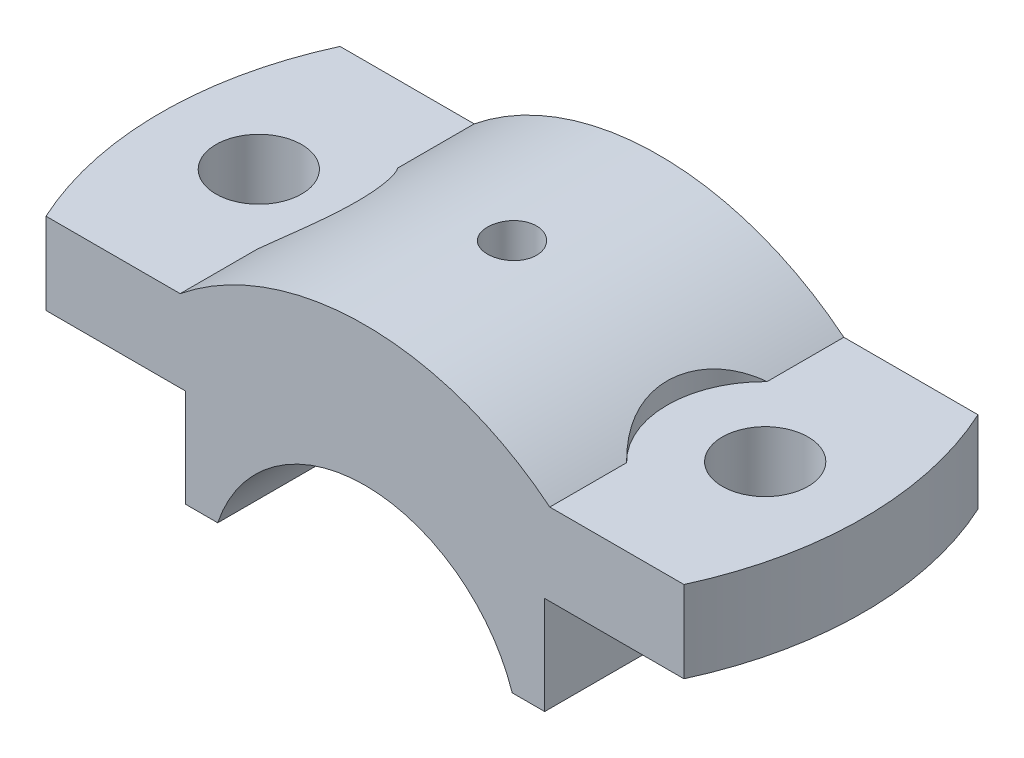
ISO-10303-21;
HEADER;
FILE_DESCRIPTION(('STEP AP214'),'2;1');
FILE_NAME('part.step','',(''),(''),'','','');
FILE_SCHEMA(('AUTOMOTIVE_DESIGN { 1 0 10303 214 1 1 1 1 }'));
ENDSEC;
DATA;
#1=APPLICATION_CONTEXT('core data for automotive mechanical design processes');
#2=APPLICATION_PROTOCOL_DEFINITION('international standard','automotive_design',2000,#1);
#3=PRODUCT_CONTEXT('',#1,'mechanical');
#4=PRODUCT('Part','Part','',(#3));
#5=PRODUCT_RELATED_PRODUCT_CATEGORY('part','',(#4));
#6=PRODUCT_DEFINITION_FORMATION('','',#4);
#7=PRODUCT_DEFINITION_CONTEXT('part definition',#1,'design');
#8=PRODUCT_DEFINITION('design','',#6,#7);
#9=PRODUCT_DEFINITION_SHAPE('','',#8);
#10=(LENGTH_UNIT() NAMED_UNIT(*) SI_UNIT(.MILLI.,.METRE.));
#11=(NAMED_UNIT(*) PLANE_ANGLE_UNIT() SI_UNIT($,.RADIAN.));
#12=(NAMED_UNIT(*) SI_UNIT($,.STERADIAN.) SOLID_ANGLE_UNIT());
#13=UNCERTAINTY_MEASURE_WITH_UNIT(LENGTH_MEASURE(1.E-05),#10,'distance_accuracy_value','');
#14=(GEOMETRIC_REPRESENTATION_CONTEXT(3) GLOBAL_UNCERTAINTY_ASSIGNED_CONTEXT((#13)) GLOBAL_UNIT_ASSIGNED_CONTEXT((#10,
#11,#12)) REPRESENTATION_CONTEXT('',''));
#15=CARTESIAN_POINT('',(0.,0.,0.));
#16=DIRECTION('',(0.,0.,1.));
#17=DIRECTION('',(1.,0.,0.));
#18=AXIS2_PLACEMENT_3D('',#15,#16,#17);
#19=CARTESIAN_POINT('',(0.,-7.77371006458449,36.));
#20=DIRECTION('',(0.,0.,-1.));
#21=DIRECTION('',(-1.,0.,0.));
#22=AXIS2_PLACEMENT_3D('',#19,#20,#21);
#23=CYLINDRICAL_SURFACE('',#22,36.);
#24=CARTESIAN_POINT('',(-3.,28.1010721647197,18.));
#25=CARTESIAN_POINT('',(-2.99999265249114,28.1010738236663,18.1681971263712));
#26=CARTESIAN_POINT('',(-2.98580727587947,28.1022677748941,18.336508758473));
#27=CARTESIAN_POINT('',(-2.92942793722287,28.1069145278935,18.6684750610303));
#28=CARTESIAN_POINT('',(-2.88720223908497,28.1103698890695,18.8321242353828));
#29=CARTESIAN_POINT('',(-2.77597195421258,28.1191454002958,19.149909588376));
#30=CARTESIAN_POINT('',(-2.70698254912659,28.1244644929836,19.3040511028649));
#31=CARTESIAN_POINT('',(-2.54421020545637,28.136366816464,19.5985295856297));
#32=CARTESIAN_POINT('',(-2.45043256743808,28.1429497769166,19.7388694963651));
#33=CARTESIAN_POINT('',(-2.24048560937411,28.1566570788,20.0021580091999));
#34=CARTESIAN_POINT('',(-2.12426580420564,28.1637826184863,20.1250662955889));
#35=CARTESIAN_POINT('',(-1.87284036202829,28.1777612337387,20.3496562987141));
#36=CARTESIAN_POINT('',(-1.73763389596104,28.1846142973902,20.4513370880627));
#37=CARTESIAN_POINT('',(-1.45183273592638,28.197287150641,20.6307198439685));
#38=CARTESIAN_POINT('',(-1.30121607637758,28.2031054320139,20.7083869295443));
#39=CARTESIAN_POINT('',(-0.989023201496296,28.2130402485841,20.8373144733555));
#40=CARTESIAN_POINT('',(-0.827447178048493,28.2171568135674,20.8885753937946));
#41=CARTESIAN_POINT('',(-0.49832338784344,28.2232159989956,20.9631194515681));
#42=CARTESIAN_POINT('',(-0.330790488696972,28.2251636868141,20.9864678133583));
#43=CARTESIAN_POINT('',(0.00582684566945136,28.2266828374423,21.0047256095538));
#44=CARTESIAN_POINT('',(0.17491125197864,28.2262543444403,20.9996355728097));
#45=CARTESIAN_POINT('',(0.50938965455644,28.2230735945792,20.9612144034619));
#46=CARTESIAN_POINT('',(0.674791770217393,28.2203271090914,20.9279534105874));
#47=CARTESIAN_POINT('',(0.997657398120732,28.2128259310541,20.8342435471137));
#48=CARTESIAN_POINT('',(1.1551208348145,28.2080712193974,20.7737944178323));
#49=CARTESIAN_POINT('',(1.45786248191057,28.1970785727843,20.6273460386443));
#50=CARTESIAN_POINT('',(1.60312542797692,28.1908388161764,20.5413153762037));
#51=CARTESIAN_POINT('',(1.8771760076321,28.1775772934931,20.3461688352641));
#52=CARTESIAN_POINT('',(2.00596330694961,28.1705555115567,20.2370524885031));
#53=CARTESIAN_POINT('',(2.24381689434569,28.1564938778336,19.9984366801342));
#54=CARTESIAN_POINT('',(2.35282204999508,28.1494540359954,19.8688762715436));
#55=CARTESIAN_POINT('',(2.54754479676811,28.1361711885869,19.593262484651));
#56=CARTESIAN_POINT('',(2.63326236869494,28.1299281836733,19.4472090927535));
#57=CARTESIAN_POINT('',(2.77897441377975,28.1189447183251,19.1427123366846));
#58=CARTESIAN_POINT('',(2.8389657142041,28.1142044432358,18.9842674471593));
#59=CARTESIAN_POINT('',(2.93147702108552,28.106766733815,18.659505845847));
#60=CARTESIAN_POINT('',(2.9639976050844,28.104069256536,18.4931892996306));
#61=CARTESIAN_POINT('',(3.00056694873785,28.1010295223116,18.1579404403341));
#62=CARTESIAN_POINT('',(3.00470095835366,28.1006802134627,17.9890174876593));
#63=CARTESIAN_POINT('',(2.98460311513446,28.10235775183,17.6528809690511));
#64=CARTESIAN_POINT('',(2.96037152687646,28.1043845768831,17.4856673871884));
#65=CARTESIAN_POINT('',(2.88430140372744,28.1105795797579,17.1579409326014));
#66=CARTESIAN_POINT('',(2.83250265296835,28.1147446713897,16.9974187621107));
#67=CARTESIAN_POINT('',(2.70280902668952,28.1247443448039,16.6873437535088));
#68=CARTESIAN_POINT('',(2.6249137324412,28.1305789533742,16.5377910914542));
#69=CARTESIAN_POINT('',(2.44502246393684,28.1432773393111,16.2535102433422));
#70=CARTESIAN_POINT('',(2.34296968105511,28.1501435284178,16.1188181148047));
#71=CARTESIAN_POINT('',(2.11774238524652,28.1641232686289,15.8684461772795));
#72=CARTESIAN_POINT('',(1.9945675088678,28.1712368239881,15.752766695513));
#73=CARTESIAN_POINT('',(1.73022411873523,28.1849307686803,15.5434127826899));
#74=CARTESIAN_POINT('',(1.58901165722949,28.1915097893577,15.4497937409906));
#75=CARTESIAN_POINT('',(1.29282057964321,28.2033736515472,15.2875982593064));
#76=CARTESIAN_POINT('',(1.13784210114533,28.2086585059917,15.2190215690739));
#77=CARTESIAN_POINT('',(0.818716736301112,28.217332271996,15.1089525527518));
#78=CARTESIAN_POINT('',(0.654581731561816,28.2207235804705,15.0674259745625));
#79=CARTESIAN_POINT('',(0.321639537198894,28.2252378753104,15.0125240227377));
#80=CARTESIAN_POINT('',(0.152832436073484,28.2263609046116,14.9991481162453));
#81=CARTESIAN_POINT('',(-0.184116145187707,28.2262121716169,15.0009334188029));
#82=CARTESIAN_POINT('',(-0.352258092634159,28.2249476533561,15.0160083055156));
#83=CARTESIAN_POINT('',(-0.683613336184001,28.2201802372818,15.0740872635346));
#84=CARTESIAN_POINT('',(-0.846826625592842,28.2166773364281,15.1170913727751));
#85=CARTESIAN_POINT('',(-1.16369713934625,28.2078261865336,15.2297861103671));
#86=CARTESIAN_POINT('',(-1.31735491836078,28.2024780447219,15.2994751880488));
#87=CARTESIAN_POINT('',(-1.61080371869707,28.1905347342392,15.4635517361931));
#88=CARTESIAN_POINT('',(-1.75059495925817,28.1839395852891,15.5579388160776));
#89=CARTESIAN_POINT('',(-2.01278426827638,28.1702186904644,15.7690560445473));
#90=CARTESIAN_POINT('',(-2.13513082795384,28.16309146422,15.8858500660396));
#91=CARTESIAN_POINT('',(-2.35853347967863,28.1491222848219,16.1383505061779));
#92=CARTESIAN_POINT('',(-2.45958440834469,28.1422804011748,16.2740614982487));
#93=CARTESIAN_POINT('',(-2.63766413693657,28.1296426676758,16.5608070021028));
#94=CARTESIAN_POINT('',(-2.7146475703754,28.1238488018617,16.7118697500037));
#95=CARTESIAN_POINT('',(-2.84205870280139,28.1139873235733,17.0247223102038));
#96=CARTESIAN_POINT('',(-2.8925169327884,28.1099177274845,17.1864995472517));
#97=CARTESIAN_POINT('',(-2.95259429401826,28.1050121810574,17.4576926526816));
#98=CARTESIAN_POINT('',(-2.97034780217531,28.1035414670871,17.5653643583357));
#99=CARTESIAN_POINT('',(-2.99405302051998,28.1015709225845,17.7820080095245));
#100=CARTESIAN_POINT('',(-3.00000476242246,28.1010710894431,17.8909799515644));
#101=CARTESIAN_POINT('',(-3.,28.1010721647197,18.));
#102=B_SPLINE_CURVE_WITH_KNOTS('',3,(#24,#25,#26,#27,#28,#29,#30,#31,#32,#33,#34,#35,#36,#37,
#38,#39,#40,#41,#42,#43,#44,#45,#46,#47,#48,#49,#50,#51,#52,#53,#54,#55,#56,#57,#58,#59,#60,#61,
#62,#63,#64,#65,#66,#67,#68,#69,#70,#71,#72,#73,#74,#75,#76,#77,#78,#79,#80,#81,#82,#83,#84,#85,
#86,#87,#88,#89,#90,#91,#92,#93,#94,#95,#96,#97,#98,#99,#100,#101),.UNSPECIFIED.,.T.,.F.,(4,2,2,
2,2,2,2,2,2,2,2,2,2,2,2,2,2,2,2,2,2,2,2,2,2,2,2,2,2,2,2,2,2,2,2,2,2,2,4),(0.,0.50419332615178,
1.00895827415152,1.51343731313157,2.01780856450747,2.52332793567524,3.02886938736902,
3.53514174781416,4.04140524635332,4.54648341066067,5.05155218238313,5.5553671237405,
6.05918685875926,6.56362782603015,7.06807902618742,7.57406352068416,8.08004843228119,
8.5860957273444,9.09213238305128,9.59664865289721,10.1011602169604,10.6049456510942,
11.1087391690364,11.6137293852901,12.1187282918785,12.6249819521095,13.1312305532239,
13.6368368664301,14.1424336090558,14.6464987901218,15.150564655824,15.6546012345849,
16.1586298429161,16.6641171697108,17.1697269173214,17.6762840561615,18.1822568546215,
18.509059872828,18.8358620128162),.UNSPECIFIED.);
#103=CARTESIAN_POINT('',(-3.,28.1010721647197,18.));
#104=VERTEX_POINT('',#103);
#105=EDGE_CURVE('E162',#104,#104,#102,.T.);
#106=ORIENTED_EDGE('',*,*,#105,.F.);
#107=EDGE_LOOP('',(#106));
#108=FACE_BOUND('',#107,.T.);
#109=DIRECTION('',(0.,0.,-1.));
#110=VECTOR('',#109,1.);
#111=CARTESIAN_POINT('',(22.6274169979695,20.2262899354155,36.));
#112=LINE('',#111,#110);
#113=CARTESIAN_POINT('',(22.6274169979695,20.2262899354155,36.));
#114=VERTEX_POINT('',#113);
#115=CARTESIAN_POINT('',(22.6274169979695,20.2262899354155,26.5965024209913));
#116=VERTEX_POINT('',#115);
#117=EDGE_CURVE('E161',#114,#116,#112,.T.);
#118=ORIENTED_EDGE('',*,*,#117,.T.);
#119=CARTESIAN_POINT('',(22.6274169979695,20.2262899354155,26.5965024209913));
#120=CARTESIAN_POINT('',(22.4322270983611,20.384051554511,26.4064520805988));
#121=CARTESIAN_POINT('',(22.2408159679431,20.5353363291669,26.2070210442905));
#122=CARTESIAN_POINT('',(21.8678088582193,20.824441817252,25.7898128345942));
#123=CARTESIAN_POINT('',(21.6862182646724,20.9622551755051,25.5720257586081));
#124=CARTESIAN_POINT('',(21.3348836471708,21.2240651870728,25.1181555921772));
#125=CARTESIAN_POINT('',(21.165170714396,21.3480260508678,24.8820276647511));
#126=CARTESIAN_POINT('',(20.8405007439178,21.5812463170682,24.3930175775049));
#127=CARTESIAN_POINT('',(20.6855409193824,21.6905084976418,24.1401385972898));
#128=CARTESIAN_POINT('',(20.3920658123467,21.8943825560363,23.6179845993479));
#129=CARTESIAN_POINT('',(20.2536131362569,21.9889390481299,23.3486526754303));
#130=CARTESIAN_POINT('',(19.9959163311309,22.162680828872,22.7961505069643));
#131=CARTESIAN_POINT('',(19.8766736417279,22.2418649655776,22.5129792273387));
#132=CARTESIAN_POINT('',(19.6594406482156,22.38459351415,21.935324688129));
#133=CARTESIAN_POINT('',(19.5614166552583,22.4481627397087,21.6408602469487));
#134=CARTESIAN_POINT('',(19.3879280706971,22.5597517056168,21.0424990460608));
#135=CARTESIAN_POINT('',(19.3124617722348,22.607772622473,20.73860300193));
#136=CARTESIAN_POINT('',(19.1892166397906,22.6857538390718,20.142919119362));
#137=CARTESIAN_POINT('',(19.1400121907461,22.7166487001658,19.8515474725118));
#138=CARTESIAN_POINT('',(19.0631808767867,22.7647443612081,19.2648574786471));
#139=CARTESIAN_POINT('',(19.0355532514876,22.7819456437293,18.9695392710855));
#140=CARTESIAN_POINT('',(19.002254790837,22.8026647792957,18.3770700269548));
#141=CARTESIAN_POINT('',(18.9965928894832,22.8061770646935,18.07991829385));
#142=CARTESIAN_POINT('',(19.0073299289777,22.799504529719,17.4861693903819));
#143=CARTESIAN_POINT('',(19.0237285420916,22.7893199128301,17.1895722118456));
#144=CARTESIAN_POINT('',(19.0774580083948,22.7558093024556,16.6088806968658));
#145=CARTESIAN_POINT('',(19.1140848284446,22.7329251860416,16.3246952993646));
#146=CARTESIAN_POINT('',(19.2072767411361,22.6743366005863,15.7609615780046));
#147=CARTESIAN_POINT('',(19.26384130746,22.6386324699678,15.4814131319431));
#148=CARTESIAN_POINT('',(19.3961445681827,22.5544239556522,14.9289768025356));
#149=CARTESIAN_POINT('',(19.4718761041906,22.5059243504631,14.6560864741728));
#150=CARTESIAN_POINT('',(19.6415371167517,22.3961460576125,14.1186698894739));
#151=CARTESIAN_POINT('',(19.7354665648503,22.3348673899325,13.8541436200604));
#152=CARTESIAN_POINT('',(19.9413916636029,22.1988819314401,13.3323808976494));
#153=CARTESIAN_POINT('',(20.0535672712639,22.1240404353675,13.0752506451727));
#154=CARTESIAN_POINT('',(20.2938117378019,21.9614917948721,12.5727445140172));
#155=CARTESIAN_POINT('',(20.4218816062816,21.8737838331077,12.3273693833965));
#156=CARTESIAN_POINT('',(20.6923158629557,21.6856718344762,11.8496338455381));
#157=CARTESIAN_POINT('',(20.8346837503104,21.5852646881653,11.617276645965));
#158=CARTESIAN_POINT('',(21.1318830089593,21.3720780182264,11.1667650996505));
#159=CARTESIAN_POINT('',(21.2867116029947,21.2593012495344,10.9486076075577));
#160=CARTESIAN_POINT('',(21.6316420205267,21.0034493433731,10.4948679256481));
#161=CARTESIAN_POINT('',(21.8235122331155,20.8583799563106,10.2617429947726));
#162=CARTESIAN_POINT('',(22.1194969072285,20.6295183700034,9.92790348594888));
#163=CARTESIAN_POINT('',(22.2193874990085,20.5514629071178,9.8193948528776));
#164=CARTESIAN_POINT('',(22.4216320252293,20.3916416190586,9.60756086294169));
#165=CARTESIAN_POINT('',(22.5239856417735,20.3098762715168,9.50423484242373));
#166=CARTESIAN_POINT('',(22.6274169979695,20.2262899354155,9.40349757900867));
#167=B_SPLINE_CURVE_WITH_KNOTS('',3,(#119,#120,#121,#122,#123,#124,#125,#126,#127,#128,#129,
#130,#131,#132,#133,#134,#135,#136,#137,#138,#139,#140,#141,#142,#143,#144,#145,#146,#147,#148,
#149,#150,#151,#152,#153,#154,#155,#156,#157,#158,#159,#160,#161,#162,#163,#164,#165,#166),
.UNSPECIFIED.,.F.,.F.,(4,2,2,2,2,2,2,2,2,2,2,2,2,2,2,2,2,2,2,2,2,2,2,4),(0.,0.944323015173848,
1.88915876897057,2.83638177556274,3.78342549717111,4.73395390710562,5.68455351836246,
6.63363261237353,7.58263987483792,8.47285606561913,9.36304088307088,10.2535877225453,
11.1441213320612,12.0054529905966,12.8667619133468,13.7277496319051,14.5887360042209,
15.4587957815584,16.3289108533596,17.1992393901148,18.0693744812538,19.072928895062,
19.573415688155,20.07383822752),.UNSPECIFIED.);
#168=CARTESIAN_POINT('',(22.6274169979695,20.2262899354155,9.40349757900866));
#169=VERTEX_POINT('',#168);
#170=EDGE_CURVE('E152',#116,#169,#167,.T.);
#171=ORIENTED_EDGE('',*,*,#170,.T.);
#172=CARTESIAN_POINT('',(22.6274169979695,20.2262899354155,0.));
#173=VERTEX_POINT('',#172);
#174=EDGE_CURVE('E158',#169,#173,#112,.T.);
#175=ORIENTED_EDGE('',*,*,#174,.T.);
#176=CARTESIAN_POINT('',(0.,-7.77371006458449,0.));
#177=DIRECTION('',(0.,0.,-1.));
#178=DIRECTION('',(-1.,0.,0.));
#179=AXIS2_PLACEMENT_3D('',#176,#177,#178);
#180=CIRCLE('',#179,36.);
#181=CARTESIAN_POINT('',(-22.6274169979695,20.2262899354155,0.));
#182=VERTEX_POINT('',#181);
#183=EDGE_CURVE('E365',#182,#173,#180,.T.);
#184=ORIENTED_EDGE('',*,*,#183,.F.);
#185=DIRECTION('',(0.,0.,-1.));
#186=VECTOR('',#185,1.);
#187=CARTESIAN_POINT('',(-22.6274169979695,20.2262899354155,36.));
#188=LINE('',#187,#186);
#189=CARTESIAN_POINT('',(-22.6274169979695,20.2262899354155,9.40349757900866));
#190=VERTEX_POINT('',#189);
#191=EDGE_CURVE('E330',#190,#182,#188,.T.);
#192=ORIENTED_EDGE('',*,*,#191,.F.);
#193=CARTESIAN_POINT('',(-22.6274169979695,20.2262899354155,26.5965024209913));
#194=CARTESIAN_POINT('',(-22.4322270983611,20.384051554511,26.4064520805988));
#195=CARTESIAN_POINT('',(-22.2408159679431,20.5353363291668,26.2070210442905));
#196=CARTESIAN_POINT('',(-21.8678088582193,20.824441817252,25.7898128345941));
#197=CARTESIAN_POINT('',(-21.6862182646724,20.9622551755051,25.5720257586081));
#198=CARTESIAN_POINT('',(-21.3348836471708,21.2240651870728,25.1181555921772));
#199=CARTESIAN_POINT('',(-21.165170714396,21.3480260508678,24.8820276647511));
#200=CARTESIAN_POINT('',(-20.8405007439178,21.5812463170682,24.3930175775049));
#201=CARTESIAN_POINT('',(-20.6855409193824,21.6905084976418,24.1401385972898));
#202=CARTESIAN_POINT('',(-20.3920658123467,21.8943825560363,23.6179845993479));
#203=CARTESIAN_POINT('',(-20.2536131362569,21.9889390481299,23.3486526754303));
#204=CARTESIAN_POINT('',(-19.9959163311309,22.1626808288719,22.7961505069642));
#205=CARTESIAN_POINT('',(-19.8766736417279,22.2418649655776,22.5129792273387));
#206=CARTESIAN_POINT('',(-19.6594406482156,22.38459351415,21.935324688129));
#207=CARTESIAN_POINT('',(-19.5614166552583,22.4481627397087,21.6408602469487));
#208=CARTESIAN_POINT('',(-19.3879280706971,22.5597517056168,21.0424990460608));
#209=CARTESIAN_POINT('',(-19.3124617722348,22.607772622473,20.73860300193));
#210=CARTESIAN_POINT('',(-19.1892166397906,22.6857538390718,20.142919119362));
#211=CARTESIAN_POINT('',(-19.1400121907461,22.7166487001658,19.8515474725118));
#212=CARTESIAN_POINT('',(-19.0631808767867,22.7647443612081,19.2648574786471));
#213=CARTESIAN_POINT('',(-19.0355532514876,22.7819456437293,18.9695392710855));
#214=CARTESIAN_POINT('',(-19.002254790837,22.8026647792957,18.3770700269548));
#215=CARTESIAN_POINT('',(-18.9965928894832,22.8061770646935,18.07991829385));
#216=CARTESIAN_POINT('',(-19.0073299289777,22.799504529719,17.4861693903819));
#217=CARTESIAN_POINT('',(-19.0237285420916,22.7893199128301,17.1895722118455));
#218=CARTESIAN_POINT('',(-19.0774580083948,22.7558093024556,16.6088806968657));
#219=CARTESIAN_POINT('',(-19.1140848284446,22.7329251860416,16.3246952993646));
#220=CARTESIAN_POINT('',(-19.2072767411361,22.6743366005862,15.7609615780046));
#221=CARTESIAN_POINT('',(-19.26384130746,22.6386324699678,15.4814131319431));
#222=CARTESIAN_POINT('',(-19.3961445681827,22.5544239556522,14.9289768025356));
#223=CARTESIAN_POINT('',(-19.4718761041906,22.5059243504631,14.6560864741728));
#224=CARTESIAN_POINT('',(-19.6415371167517,22.3961460576125,14.1186698894739));
#225=CARTESIAN_POINT('',(-19.7354665648503,22.3348673899325,13.8541436200604));
#226=CARTESIAN_POINT('',(-19.9413916636029,22.1988819314401,13.3323808976494));
#227=CARTESIAN_POINT('',(-20.0535672712639,22.1240404353675,13.0752506451727));
#228=CARTESIAN_POINT('',(-20.2938117378019,21.9614917948721,12.5727445140172));
#229=CARTESIAN_POINT('',(-20.4218816062816,21.8737838331077,12.3273693833965));
#230=CARTESIAN_POINT('',(-20.6923158629557,21.6856718344762,11.8496338455381));
#231=CARTESIAN_POINT('',(-20.8346837503104,21.5852646881653,11.617276645965));
#232=CARTESIAN_POINT('',(-21.1318830089593,21.3720780182264,11.1667650996505));
#233=CARTESIAN_POINT('',(-21.2867116029947,21.2593012495344,10.9486076075577));
#234=CARTESIAN_POINT('',(-21.6316420205267,21.0034493433731,10.4948679256481));
#235=CARTESIAN_POINT('',(-21.8235122331155,20.8583799563106,10.2617429947726));
#236=CARTESIAN_POINT('',(-22.1194969072285,20.6295183700034,9.92790348594887));
#237=CARTESIAN_POINT('',(-22.2193874990085,20.5514629071178,9.81939485287759));
#238=CARTESIAN_POINT('',(-22.4216320252293,20.3916416190586,9.60756086294168));
#239=CARTESIAN_POINT('',(-22.5239856417735,20.3098762715168,9.50423484242372));
#240=CARTESIAN_POINT('',(-22.6274169979695,20.2262899354155,9.40349757900865));
#241=B_SPLINE_CURVE_WITH_KNOTS('',3,(#193,#194,#195,#196,#197,#198,#199,#200,#201,#202,#203,
#204,#205,#206,#207,#208,#209,#210,#211,#212,#213,#214,#215,#216,#217,#218,#219,#220,#221,#222,
#223,#224,#225,#226,#227,#228,#229,#230,#231,#232,#233,#234,#235,#236,#237,#238,#239,#240),
.UNSPECIFIED.,.F.,.F.,(4,2,2,2,2,2,2,2,2,2,2,2,2,2,2,2,2,2,2,2,2,2,2,4),(0.,0.944323015173849,
1.88915876897058,2.83638177556274,3.78342549717111,4.73395390710562,5.68455351836245,
6.63363261237353,7.58263987483792,8.47285606561913,9.36304088307088,10.2535877225453,
11.1441213320612,12.0054529905966,12.8667619133468,13.7277496319051,14.5887360042209,
15.4587957815584,16.3289108533596,17.1992393901148,18.0693744812538,19.072928895062,
19.573415688155,20.07383822752),.UNSPECIFIED.);
#242=CARTESIAN_POINT('',(-22.6274169979695,20.2262899354155,26.5965024209913));
#243=VERTEX_POINT('',#242);
#244=EDGE_CURVE('E163',#243,#190,#241,.T.);
#245=ORIENTED_EDGE('',*,*,#244,.F.);
#246=CARTESIAN_POINT('',(-22.6274169979695,20.2262899354155,36.));
#247=VERTEX_POINT('',#246);
#248=EDGE_CURVE('E182',#247,#243,#188,.T.);
#249=ORIENTED_EDGE('',*,*,#248,.F.);
#250=CARTESIAN_POINT('',(0.,-7.77371006458449,36.));
#251=DIRECTION('',(0.,0.,-1.));
#252=DIRECTION('',(-1.,0.,0.));
#253=AXIS2_PLACEMENT_3D('',#250,#251,#252);
#254=CIRCLE('',#253,36.);
#255=EDGE_CURVE('E328',#247,#114,#254,.T.);
#256=ORIENTED_EDGE('',*,*,#255,.T.);
#257=EDGE_LOOP('',(#118,#171,#175,#184,#192,#245,#249,#256));
#258=FACE_BOUND('',#257,.T.);
#259=ADVANCED_FACE('F51',(#108,#258),#23,.T.);
#260=CARTESIAN_POINT('',(43.,10.2262899354155,36.));
#261=DIRECTION('',(0.,-1.,0.));
#262=DIRECTION('',(1.,0.,0.));
#263=AXIS2_PLACEMENT_3D('',#260,#261,#262);
#264=PLANE('',#263);
#265=CARTESIAN_POINT('',(31.,10.2262899354155,18.));
#266=DIRECTION('',(0.,1.,0.));
#267=DIRECTION('',(-1.,0.,0.));
#268=AXIS2_PLACEMENT_3D('',#265,#266,#267);
#269=CIRCLE('',#268,5.25);
#270=CARTESIAN_POINT('',(25.75,10.2262899354155,18.));
#271=VERTEX_POINT('',#270);
#272=EDGE_CURVE('E395',#271,#271,#269,.T.);
#273=ORIENTED_EDGE('',*,*,#272,.T.);
#274=EDGE_LOOP('',(#273));
#275=FACE_BOUND('',#274,.T.);
#276=DIRECTION('',(-1.,0.,0.));
#277=VECTOR('',#276,1.);
#278=CARTESIAN_POINT('',(43.,10.2262899354155,0.));
#279=LINE('',#278,#277);
#280=CARTESIAN_POINT('',(39.0512483795333,10.2262899354155,0.));
#281=VERTEX_POINT('',#280);
#282=CARTESIAN_POINT('',(22.,10.2262899354155,0.));
#283=VERTEX_POINT('',#282);
#284=EDGE_CURVE('E311',#281,#283,#279,.T.);
#285=ORIENTED_EDGE('',*,*,#284,.F.);
#286=CARTESIAN_POINT('',(0.,10.2262899354155,18.));
#287=DIRECTION('',(0.,1.,0.));
#288=DIRECTION('',(-1.,0.,0.));
#289=AXIS2_PLACEMENT_3D('',#286,#287,#288);
#290=CIRCLE('',#289,43.);
#291=CARTESIAN_POINT('',(39.0512483795333,10.2262899354155,36.));
#292=VERTEX_POINT('',#291);
#293=EDGE_CURVE('E346',#292,#281,#290,.T.);
#294=ORIENTED_EDGE('',*,*,#293,.F.);
#295=DIRECTION('',(-1.,0.,0.));
#296=VECTOR('',#295,1.);
#297=CARTESIAN_POINT('',(43.,10.2262899354155,36.));
#298=LINE('',#297,#296);
#299=CARTESIAN_POINT('',(22.,10.2262899354155,36.));
#300=VERTEX_POINT('',#299);
#301=EDGE_CURVE('E345',#292,#300,#298,.T.);
#302=ORIENTED_EDGE('',*,*,#301,.T.);
#303=DIRECTION('',(0.,0.,-1.));
#304=VECTOR('',#303,1.);
#305=CARTESIAN_POINT('',(22.,10.2262899354155,36.));
#306=LINE('',#305,#304);
#307=EDGE_CURVE('E171',#300,#283,#306,.T.);
#308=ORIENTED_EDGE('',*,*,#307,.T.);
#309=EDGE_LOOP('',(#285,#294,#302,#308));
#310=FACE_BOUND('',#309,.T.);
#311=ADVANCED_FACE('F278',(#275,#310),#264,.T.);
#312=CARTESIAN_POINT('',(22.6274169979695,20.2262899354155,36.));
#313=DIRECTION('',(0.,1.,0.));
#314=DIRECTION('',(-1.,0.,0.));
#315=AXIS2_PLACEMENT_3D('',#312,#313,#314);
#316=PLANE('',#315);
#317=CARTESIAN_POINT('',(31.,20.2262899354155,18.));
#318=DIRECTION('',(0.,1.,0.));
#319=DIRECTION('',(-1.,0.,0.));
#320=AXIS2_PLACEMENT_3D('',#317,#318,#319);
#321=CIRCLE('',#320,5.25);
#322=CARTESIAN_POINT('',(25.75,20.2262899354155,18.));
#323=VERTEX_POINT('',#322);
#324=EDGE_CURVE('E396',#323,#323,#321,.T.);
#325=ORIENTED_EDGE('',*,*,#324,.F.);
#326=EDGE_LOOP('',(#325));
#327=FACE_BOUND('',#326,.T.);
#328=CARTESIAN_POINT('',(0.,20.2262899354155,18.));
#329=DIRECTION('',(0.,1.,0.));
#330=DIRECTION('',(-1.,0.,0.));
#331=AXIS2_PLACEMENT_3D('',#328,#329,#330);
#332=CIRCLE('',#331,43.);
#333=CARTESIAN_POINT('',(39.0512483795333,20.2262899354155,36.));
#334=VERTEX_POINT('',#333);
#335=CARTESIAN_POINT('',(39.0512483795333,20.2262899354155,0.));
#336=VERTEX_POINT('',#335);
#337=EDGE_CURVE('E391',#334,#336,#332,.T.);
#338=ORIENTED_EDGE('',*,*,#337,.T.);
#339=DIRECTION('',(1.,0.,0.));
#340=VECTOR('',#339,1.);
#341=CARTESIAN_POINT('',(22.6274169979695,20.2262899354155,0.));
#342=LINE('',#341,#340);
#343=EDGE_CURVE('E167',#173,#336,#342,.T.);
#344=ORIENTED_EDGE('',*,*,#343,.F.);
#345=ORIENTED_EDGE('',*,*,#174,.F.);
#346=CARTESIAN_POINT('',(31.,20.2262899354155,18.));
#347=DIRECTION('',(0.,1.,0.));
#348=DIRECTION('',(-1.,0.,0.));
#349=AXIS2_PLACEMENT_3D('',#346,#347,#348);
#350=CIRCLE('',#349,12.);
#351=EDGE_CURVE('E66',#169,#116,#350,.T.);
#352=ORIENTED_EDGE('',*,*,#351,.T.);
#353=ORIENTED_EDGE('',*,*,#117,.F.);
#354=DIRECTION('',(1.,0.,0.));
#355=VECTOR('',#354,1.);
#356=CARTESIAN_POINT('',(22.6274169979695,20.2262899354155,36.));
#357=LINE('',#356,#355);
#358=EDGE_CURVE('E349',#114,#334,#357,.T.);
#359=ORIENTED_EDGE('',*,*,#358,.T.);
#360=EDGE_LOOP('',(#338,#344,#345,#352,#353,#359));
#361=FACE_BOUND('',#360,.T.);
#362=ADVANCED_FACE('F165',(#327,#361),#316,.T.);
#363=CARTESIAN_POINT('',(0.,-7.77371006458449,0.));
#364=DIRECTION('',(0.,0.,-1.));
#365=DIRECTION('',(-1.,0.,0.));
#366=AXIS2_PLACEMENT_3D('',#363,#364,#365);
#367=PLANE('',#366);
#368=ORIENTED_EDGE('',*,*,#343,.T.);
#369=DIRECTION('',(0.,1.,0.));
#370=VECTOR('',#369,1.);
#371=CARTESIAN_POINT('',(39.0512483795333,10.2262899354155,0.));
#372=LINE('',#371,#370);
#373=EDGE_CURVE('E369',#281,#336,#372,.T.);
#374=ORIENTED_EDGE('',*,*,#373,.F.);
#375=ORIENTED_EDGE('',*,*,#284,.T.);
#376=DIRECTION('',(0.,-1.,0.));
#377=VECTOR('',#376,1.);
#378=CARTESIAN_POINT('',(22.,10.2262899354155,0.));
#379=LINE('',#378,#377);
#380=CARTESIAN_POINT('',(22.,-1.77371006458449,0.));
#381=VERTEX_POINT('',#380);
#382=EDGE_CURVE('E302',#283,#381,#379,.T.);
#383=ORIENTED_EDGE('',*,*,#382,.T.);
#384=DIRECTION('',(1.,0.,0.));
#385=VECTOR('',#384,1.);
#386=CARTESIAN_POINT('',(18.0277563773199,-1.77371006458449,0.));
#387=LINE('',#386,#385);
#388=CARTESIAN_POINT('',(18.0277563773199,-1.77371006458449,0.));
#389=VERTEX_POINT('',#388);
#390=EDGE_CURVE('E310',#389,#381,#387,.T.);
#391=ORIENTED_EDGE('',*,*,#390,.F.);
#392=CARTESIAN_POINT('',(0.,-7.77371006458449,0.));
#393=DIRECTION('',(0.,0.,-1.));
#394=DIRECTION('',(-1.,0.,0.));
#395=AXIS2_PLACEMENT_3D('',#392,#393,#394);
#396=CIRCLE('',#395,19.);
#397=CARTESIAN_POINT('',(-18.0277563773199,-1.77371006458449,0.));
#398=VERTEX_POINT('',#397);
#399=EDGE_CURVE('E313',#398,#389,#396,.T.);
#400=ORIENTED_EDGE('',*,*,#399,.F.);
#401=DIRECTION('',(1.,0.,0.));
#402=VECTOR('',#401,1.);
#403=CARTESIAN_POINT('',(-22.,-1.77371006458449,0.));
#404=LINE('',#403,#402);
#405=CARTESIAN_POINT('',(-22.,-1.77371006458449,0.));
#406=VERTEX_POINT('',#405);
#407=EDGE_CURVE('E319',#406,#398,#404,.T.);
#408=ORIENTED_EDGE('',*,*,#407,.F.);
#409=DIRECTION('',(0.,-1.,0.));
#410=VECTOR('',#409,1.);
#411=CARTESIAN_POINT('',(-22.,10.2262899354155,0.));
#412=LINE('',#411,#410);
#413=CARTESIAN_POINT('',(-22.,10.2262899354155,0.));
#414=VERTEX_POINT('',#413);
#415=EDGE_CURVE('E321',#414,#406,#412,.T.);
#416=ORIENTED_EDGE('',*,*,#415,.F.);
#417=DIRECTION('',(1.,0.,0.));
#418=VECTOR('',#417,1.);
#419=CARTESIAN_POINT('',(-43.,10.2262899354155,0.));
#420=LINE('',#419,#418);
#421=CARTESIAN_POINT('',(-39.0512483795332,10.2262899354155,0.));
#422=VERTEX_POINT('',#421);
#423=EDGE_CURVE('E323',#422,#414,#420,.T.);
#424=ORIENTED_EDGE('',*,*,#423,.F.);
#425=DIRECTION('',(0.,1.,0.));
#426=VECTOR('',#425,1.);
#427=CARTESIAN_POINT('',(-39.0512483795332,10.2262899354155,0.));
#428=LINE('',#427,#426);
#429=CARTESIAN_POINT('',(-39.0512483795333,20.2262899354155,0.));
#430=VERTEX_POINT('',#429);
#431=EDGE_CURVE('E366',#422,#430,#428,.T.);
#432=ORIENTED_EDGE('',*,*,#431,.T.);
#433=DIRECTION('',(-1.,0.,0.));
#434=VECTOR('',#433,1.);
#435=CARTESIAN_POINT('',(-22.6274169979695,20.2262899354155,0.));
#436=LINE('',#435,#434);
#437=EDGE_CURVE('E325',#182,#430,#436,.T.);
#438=ORIENTED_EDGE('',*,*,#437,.F.);
#439=ORIENTED_EDGE('',*,*,#183,.T.);
#440=EDGE_LOOP('',(#368,#374,#375,#383,#391,#400,#408,#416,#424,#432,#438,#439));
#441=FACE_BOUND('',#440,.T.);
#442=ADVANCED_FACE('F218',(#441),#367,.T.);
#443=CARTESIAN_POINT('',(0.,-7.77371006458449,36.));
#444=DIRECTION('',(0.,0.,-1.));
#445=DIRECTION('',(-1.,0.,0.));
#446=AXIS2_PLACEMENT_3D('',#443,#444,#445);
#447=PLANE('',#446);
#448=DIRECTION('',(0.,1.,0.));
#449=VECTOR('',#448,1.);
#450=CARTESIAN_POINT('',(39.0512483795333,10.2262899354155,36.));
#451=LINE('',#450,#449);
#452=EDGE_CURVE('E384',#292,#334,#451,.T.);
#453=ORIENTED_EDGE('',*,*,#452,.T.);
#454=ORIENTED_EDGE('',*,*,#358,.F.);
#455=ORIENTED_EDGE('',*,*,#255,.F.);
#456=DIRECTION('',(-1.,0.,0.));
#457=VECTOR('',#456,1.);
#458=CARTESIAN_POINT('',(-22.6274169979695,20.2262899354155,36.));
#459=LINE('',#458,#457);
#460=CARTESIAN_POINT('',(-39.0512483795333,20.2262899354155,36.));
#461=VERTEX_POINT('',#460);
#462=EDGE_CURVE('E169',#247,#461,#459,.T.);
#463=ORIENTED_EDGE('',*,*,#462,.T.);
#464=DIRECTION('',(0.,1.,0.));
#465=VECTOR('',#464,1.);
#466=CARTESIAN_POINT('',(-39.0512483795333,10.2262899354155,36.));
#467=LINE('',#466,#465);
#468=CARTESIAN_POINT('',(-39.0512483795333,10.2262899354155,36.));
#469=VERTEX_POINT('',#468);
#470=EDGE_CURVE('E379',#469,#461,#467,.T.);
#471=ORIENTED_EDGE('',*,*,#470,.F.);
#472=DIRECTION('',(1.,0.,0.));
#473=VECTOR('',#472,1.);
#474=CARTESIAN_POINT('',(-43.,10.2262899354155,36.));
#475=LINE('',#474,#473);
#476=CARTESIAN_POINT('',(-22.,10.2262899354155,36.));
#477=VERTEX_POINT('',#476);
#478=EDGE_CURVE('E173',#469,#477,#475,.T.);
#479=ORIENTED_EDGE('',*,*,#478,.T.);
#480=DIRECTION('',(0.,-1.,0.));
#481=VECTOR('',#480,1.);
#482=CARTESIAN_POINT('',(-22.,10.2262899354155,36.));
#483=LINE('',#482,#481);
#484=CARTESIAN_POINT('',(-22.,-1.77371006458449,36.));
#485=VERTEX_POINT('',#484);
#486=EDGE_CURVE('E362',#477,#485,#483,.T.);
#487=ORIENTED_EDGE('',*,*,#486,.T.);
#488=DIRECTION('',(1.,0.,0.));
#489=VECTOR('',#488,1.);
#490=CARTESIAN_POINT('',(-22.,-1.77371006458449,36.));
#491=LINE('',#490,#489);
#492=CARTESIAN_POINT('',(-18.0277563773199,-1.77371006458449,36.));
#493=VERTEX_POINT('',#492);
#494=EDGE_CURVE('E360',#485,#493,#491,.T.);
#495=ORIENTED_EDGE('',*,*,#494,.T.);
#496=CARTESIAN_POINT('',(0.,-7.77371006458449,36.));
#497=DIRECTION('',(0.,0.,-1.));
#498=DIRECTION('',(-1.,0.,0.));
#499=AXIS2_PLACEMENT_3D('',#496,#497,#498);
#500=CIRCLE('',#499,19.);
#501=CARTESIAN_POINT('',(18.0277563773199,-1.77371006458449,36.));
#502=VERTEX_POINT('',#501);
#503=EDGE_CURVE('E358',#493,#502,#500,.T.);
#504=ORIENTED_EDGE('',*,*,#503,.T.);
#505=DIRECTION('',(1.,0.,0.));
#506=VECTOR('',#505,1.);
#507=CARTESIAN_POINT('',(18.0277563773199,-1.77371006458449,36.));
#508=LINE('',#507,#506);
#509=CARTESIAN_POINT('',(22.,-1.77371006458449,36.));
#510=VERTEX_POINT('',#509);
#511=EDGE_CURVE('E351',#502,#510,#508,.T.);
#512=ORIENTED_EDGE('',*,*,#511,.T.);
#513=DIRECTION('',(0.,-1.,0.));
#514=VECTOR('',#513,1.);
#515=CARTESIAN_POINT('',(22.,10.2262899354155,36.));
#516=LINE('',#515,#514);
#517=EDGE_CURVE('E348',#300,#510,#516,.T.);
#518=ORIENTED_EDGE('',*,*,#517,.F.);
#519=ORIENTED_EDGE('',*,*,#301,.F.);
#520=EDGE_LOOP('',(#453,#454,#455,#463,#471,#479,#487,#495,#504,#512,#518,#519));
#521=FACE_BOUND('',#520,.T.);
#522=ADVANCED_FACE('F214',(#521),#447,.F.);
#523=CARTESIAN_POINT('',(-22.6274169979695,20.2262899354155,36.));
#524=DIRECTION('',(0.,-1.,0.));
#525=DIRECTION('',(1.,0.,0.));
#526=AXIS2_PLACEMENT_3D('',#523,#524,#525);
#527=PLANE('',#526);
#528=CARTESIAN_POINT('',(-31.,20.2262899354155,18.));
#529=DIRECTION('',(0.,1.,0.));
#530=DIRECTION('',(1.,0.,0.));
#531=AXIS2_PLACEMENT_3D('',#528,#529,#530);
#532=CIRCLE('',#531,5.25);
#533=CARTESIAN_POINT('',(-25.75,20.2262899354155,18.));
#534=VERTEX_POINT('',#533);
#535=EDGE_CURVE('E401',#534,#534,#532,.T.);
#536=ORIENTED_EDGE('',*,*,#535,.F.);
#537=EDGE_LOOP('',(#536));
#538=FACE_BOUND('',#537,.T.);
#539=CARTESIAN_POINT('',(0.,20.2262899354155,18.));
#540=DIRECTION('',(0.,1.,0.));
#541=DIRECTION('',(-1.,0.,0.));
#542=AXIS2_PLACEMENT_3D('',#539,#540,#541);
#543=CIRCLE('',#542,43.);
#544=EDGE_CURVE('E375',#430,#461,#543,.T.);
#545=ORIENTED_EDGE('',*,*,#544,.T.);
#546=ORIENTED_EDGE('',*,*,#462,.F.);
#547=ORIENTED_EDGE('',*,*,#248,.T.);
#548=CARTESIAN_POINT('',(-31.,20.2262899354155,18.));
#549=DIRECTION('',(0.,-1.,0.));
#550=DIRECTION('',(1.,0.,0.));
#551=AXIS2_PLACEMENT_3D('',#548,#549,#550);
#552=CIRCLE('',#551,12.);
#553=EDGE_CURVE('E74',#190,#243,#552,.T.);
#554=ORIENTED_EDGE('',*,*,#553,.F.);
#555=ORIENTED_EDGE('',*,*,#191,.T.);
#556=ORIENTED_EDGE('',*,*,#437,.T.);
#557=EDGE_LOOP('',(#545,#546,#547,#554,#555,#556));
#558=FACE_BOUND('',#557,.T.);
#559=ADVANCED_FACE('F217',(#538,#558),#527,.F.);
#560=CARTESIAN_POINT('',(-43.,10.2262899354155,36.));
#561=DIRECTION('',(0.,1.,0.));
#562=DIRECTION('',(0.,0.,1.));
#563=AXIS2_PLACEMENT_3D('',#560,#561,#562);
#564=PLANE('',#563);
#565=CARTESIAN_POINT('',(-31.,10.2262899354155,18.));
#566=DIRECTION('',(0.,1.,0.));
#567=DIRECTION('',(1.,0.,0.));
#568=AXIS2_PLACEMENT_3D('',#565,#566,#567);
#569=CIRCLE('',#568,5.25);
#570=CARTESIAN_POINT('',(-25.75,10.2262899354155,18.));
#571=VERTEX_POINT('',#570);
#572=EDGE_CURVE('E399',#571,#571,#569,.T.);
#573=ORIENTED_EDGE('',*,*,#572,.T.);
#574=EDGE_LOOP('',(#573));
#575=FACE_BOUND('',#574,.T.);
#576=ORIENTED_EDGE('',*,*,#478,.F.);
#577=CARTESIAN_POINT('',(0.,10.2262899354155,18.));
#578=DIRECTION('',(0.,1.,0.));
#579=DIRECTION('',(-1.,0.,0.));
#580=AXIS2_PLACEMENT_3D('',#577,#578,#579);
#581=CIRCLE('',#580,43.);
#582=EDGE_CURVE('E378',#422,#469,#581,.T.);
#583=ORIENTED_EDGE('',*,*,#582,.F.);
#584=ORIENTED_EDGE('',*,*,#423,.T.);
#585=DIRECTION('',(0.,0.,-1.));
#586=VECTOR('',#585,1.);
#587=CARTESIAN_POINT('',(-22.,10.2262899354155,36.));
#588=LINE('',#587,#586);
#589=EDGE_CURVE('E331',#477,#414,#588,.T.);
#590=ORIENTED_EDGE('',*,*,#589,.F.);
#591=EDGE_LOOP('',(#576,#583,#584,#590));
#592=FACE_BOUND('',#591,.T.);
#593=ADVANCED_FACE('F225',(#575,#592),#564,.F.);
#594=CARTESIAN_POINT('',(-22.,10.2262899354155,36.));
#595=DIRECTION('',(1.,0.,0.));
#596=DIRECTION('',(0.,1.,0.));
#597=AXIS2_PLACEMENT_3D('',#594,#595,#596);
#598=PLANE('',#597);
#599=ORIENTED_EDGE('',*,*,#415,.T.);
#600=DIRECTION('',(0.,0.,-1.));
#601=VECTOR('',#600,1.);
#602=CARTESIAN_POINT('',(-22.,-1.77371006458449,36.));
#603=LINE('',#602,#601);
#604=EDGE_CURVE('E334',#485,#406,#603,.T.);
#605=ORIENTED_EDGE('',*,*,#604,.F.);
#606=ORIENTED_EDGE('',*,*,#486,.F.);
#607=ORIENTED_EDGE('',*,*,#589,.T.);
#608=EDGE_LOOP('',(#599,#605,#606,#607));
#609=FACE_BOUND('',#608,.T.);
#610=ADVANCED_FACE('F229',(#609),#598,.F.);
#611=CARTESIAN_POINT('',(-22.,-1.77371006458449,36.));
#612=DIRECTION('',(0.,1.,0.));
#613=DIRECTION('',(0.,0.,1.));
#614=AXIS2_PLACEMENT_3D('',#611,#612,#613);
#615=PLANE('',#614);
#616=ORIENTED_EDGE('',*,*,#407,.T.);
#617=DIRECTION('',(0.,0.,-1.));
#618=VECTOR('',#617,1.);
#619=CARTESIAN_POINT('',(-18.0277563773199,-1.77371006458449,36.));
#620=LINE('',#619,#618);
#621=EDGE_CURVE('E337',#493,#398,#620,.T.);
#622=ORIENTED_EDGE('',*,*,#621,.F.);
#623=ORIENTED_EDGE('',*,*,#494,.F.);
#624=ORIENTED_EDGE('',*,*,#604,.T.);
#625=EDGE_LOOP('',(#616,#622,#623,#624));
#626=FACE_BOUND('',#625,.T.);
#627=ADVANCED_FACE('F233',(#626),#615,.F.);
#628=CARTESIAN_POINT('',(0.,-7.77371006458449,36.));
#629=DIRECTION('',(0.,0.,-1.));
#630=DIRECTION('',(-1.,0.,0.));
#631=AXIS2_PLACEMENT_3D('',#628,#629,#630);
#632=CYLINDRICAL_SURFACE('',#631,19.);
#633=CARTESIAN_POINT('',(-1.5,11.1669868602913,18.));
#634=CARTESIAN_POINT('',(-1.49999631892616,11.1669876478335,18.0841146781119));
#635=CARTESIAN_POINT('',(-1.49290092424961,11.1675532145588,18.1682870031227));
#636=CARTESIAN_POINT('',(-1.46469987466451,11.1697544178,18.3343038249789));
#637=CARTESIAN_POINT('',(-1.44357824361853,11.1713912745039,18.4161455562498));
#638=CARTESIAN_POINT('',(-1.38793840804118,11.1755485124979,18.5750726118787));
#639=CARTESIAN_POINT('',(-1.35342767572229,11.1780684009084,18.6521605614741));
#640=CARTESIAN_POINT('',(-1.27200229222604,11.1837071549777,18.7994308008449));
#641=CARTESIAN_POINT('',(-1.22509033689708,11.1868258904155,18.8696145869423));
#642=CARTESIAN_POINT('',(-1.12007640172594,11.1933190610542,19.0012656861338));
#643=CARTESIAN_POINT('',(-1.0619516407736,11.196694008188,19.0627148038182));
#644=CARTESIAN_POINT('',(-0.936210053584055,11.2033146273019,19.1749960450692));
#645=CARTESIAN_POINT('',(-0.86859281731415,11.2065602936898,19.2258277097729));
#646=CARTESIAN_POINT('',(-0.725678183596238,11.2125614260372,19.3154908430535));
#647=CARTESIAN_POINT('',(-0.650370955950899,11.2153162518912,19.354306689712));
#648=CARTESIAN_POINT('',(-0.494282684880004,11.2200198122988,19.4187364117455));
#649=CARTESIAN_POINT('',(-0.413501728551608,11.2219685596749,19.4443504971292));
#650=CARTESIAN_POINT('',(-0.248939195313451,11.2248368206637,19.4815975635769));
#651=CARTESIAN_POINT('',(-0.165164283508367,11.2257584893835,19.4932598233927));
#652=CARTESIAN_POINT('',(0.00315866827375594,11.2264760401508,19.5023626796339));
#653=CARTESIAN_POINT('',(0.0877066951738365,11.2262719412053,19.499803516167));
#654=CARTESIAN_POINT('',(0.254977393596484,11.2247627355722,19.4805601612405));
#655=CARTESIAN_POINT('',(0.337703712638957,11.2234600831888,19.4639074562009));
#656=CARTESIAN_POINT('',(0.499183334296599,11.2199031445511,19.4169986635251));
#657=CARTESIAN_POINT('',(0.577936602404052,11.2176488500329,19.3867424577592));
#658=CARTESIAN_POINT('',(0.729335010453588,11.2124380605189,19.3134503018678));
#659=CARTESIAN_POINT('',(0.801973277087951,11.2094807892738,19.2704002110852));
#660=CARTESIAN_POINT('',(0.939004722145919,11.2031964946267,19.1727525893335));
#661=CARTESIAN_POINT('',(1.00339775070917,11.1998694645062,19.1181548485293));
#662=CARTESIAN_POINT('',(1.12229485990929,11.1932089665333,18.9987842098615));
#663=CARTESIAN_POINT('',(1.17677148330011,11.1898755058795,18.9339839595356));
#664=CARTESIAN_POINT('',(1.27407736376234,11.18358700151,18.7961431828597));
#665=CARTESIAN_POINT('',(1.31690661259855,11.1806319580617,18.7231026506835));
#666=CARTESIAN_POINT('',(1.38970072117186,11.1754342529761,18.5708358103037));
#667=CARTESIAN_POINT('',(1.41966421889881,11.1731916667683,18.4916088482333));
#668=CARTESIAN_POINT('',(1.46585626570516,11.1696741827118,18.3292270263132));
#669=CARTESIAN_POINT('',(1.48208507358844,11.1683992666292,18.2460722405069));
#670=CARTESIAN_POINT('',(1.50031243477698,11.1669643600642,18.078435314794));
#671=CARTESIAN_POINT('',(1.5023492488974,11.1668013719117,17.9939573595962));
#672=CARTESIAN_POINT('',(1.49223496850505,11.1676008597451,17.8258611627603));
#673=CARTESIAN_POINT('',(1.48008399257325,11.1685633263245,17.7422429139426));
#674=CARTESIAN_POINT('',(1.44197092363414,11.1715025402509,17.5783491983725));
#675=CARTESIAN_POINT('',(1.41602663114459,11.1734779802215,17.4980695667234));
#676=CARTESIAN_POINT('',(1.35108147200181,11.1782194628486,17.3430030216113));
#677=CARTESIAN_POINT('',(1.31208041700624,11.1809855169094,17.2682161874003));
#678=CARTESIAN_POINT('',(1.22203178916913,11.1870038242529,17.1260829193122));
#679=CARTESIAN_POINT('',(1.17095868713874,11.1902571024695,17.0587527035175));
#680=CARTESIAN_POINT('',(1.05825267973502,11.1968797934128,16.933607716825));
#681=CARTESIAN_POINT('',(0.996619611089645,11.2002492079346,16.8757930930788));
#682=CARTESIAN_POINT('',(0.8643780245475,11.2067334086181,16.7711901550992));
#683=CARTESIAN_POINT('',(0.793749829145913,11.2098476111713,16.724426676512));
#684=CARTESIAN_POINT('',(0.645621116961062,11.2154620967682,16.6434237685601));
#685=CARTESIAN_POINT('',(0.568120662785069,11.217962385404,16.6091842251151));
#686=CARTESIAN_POINT('',(0.408536919109431,11.2220646224508,16.5542439042479));
#687=CARTESIAN_POINT('',(0.326458973253475,11.2236675951881,16.5335276848363));
#688=CARTESIAN_POINT('',(0.159976616254469,11.2257987325315,16.5061715842802));
#689=CARTESIAN_POINT('',(0.0755722442107124,11.2263269151901,16.4995314667102));
#690=CARTESIAN_POINT('',(-0.0929220038623573,11.2262489955832,16.5005186941262));
#691=CARTESIAN_POINT('',(-0.17701211103062,11.2256459733573,16.5081072971894));
#692=CARTESIAN_POINT('',(-0.342719730035082,11.2233795051051,16.5372558700707));
#693=CARTESIAN_POINT('',(-0.424337238242838,11.2217160575226,16.5588158603902));
#694=CARTESIAN_POINT('',(-0.58278606258878,11.2175154511726,16.6152855821741));
#695=CARTESIAN_POINT('',(-0.659617587939145,11.2149783306281,16.6501947296229));
#696=CARTESIAN_POINT('',(-0.806335404250684,11.2093144568983,16.7323672434721));
#697=CARTESIAN_POINT('',(-0.876221821351096,11.2061877144248,16.7796303854389));
#698=CARTESIAN_POINT('',(-1.00726365392213,11.1996855910337,16.8853144731794));
#699=CARTESIAN_POINT('',(-1.06839598935229,11.1963095871697,16.9437639981482));
#700=CARTESIAN_POINT('',(-1.18000596543945,11.1896947092885,17.0701119751117));
#701=CARTESIAN_POINT('',(-1.23048101607813,11.1864558687584,17.1380127173791));
#702=CARTESIAN_POINT('',(-1.31940454263447,11.1804759504597,17.2814545659416));
#703=CARTESIAN_POINT('',(-1.35783215199118,11.1777357397398,17.3570086319248));
#704=CARTESIAN_POINT('',(-1.42140732631134,11.1730740100523,17.5134658263159));
#705=CARTESIAN_POINT('',(-1.44657022640418,11.1711515461988,17.5943626556898));
#706=CARTESIAN_POINT('',(-1.47646210538735,11.1688396154754,17.7297841684065));
#707=CARTESIAN_POINT('',(-1.48527715789168,11.1681480051465,17.7834367955422));
#708=CARTESIAN_POINT('',(-1.49704728684702,11.1672213738052,17.8913849359433));
#709=CARTESIAN_POINT('',(-1.50000237716279,11.1669863517125,17.9456804476872));
#710=CARTESIAN_POINT('',(-1.5,11.1669868602913,18.));
#711=B_SPLINE_CURVE_WITH_KNOTS('',3,(#633,#634,#635,#636,#637,#638,#639,#640,#641,#642,#643,
#644,#645,#646,#647,#648,#649,#650,#651,#652,#653,#654,#655,#656,#657,#658,#659,#660,#661,#662,
#663,#664,#665,#666,#667,#668,#669,#670,#671,#672,#673,#674,#675,#676,#677,#678,#679,#680,#681,
#682,#683,#684,#685,#686,#687,#688,#689,#690,#691,#692,#693,#694,#695,#696,#697,#698,#699,#700,
#701,#702,#703,#704,#705,#706,#707,#708,#709,#710),.UNSPECIFIED.,.T.,.F.,(4,2,2,2,2,2,2,2,2,2,2,
2,2,2,2,2,2,2,2,2,2,2,2,2,2,2,2,2,2,2,2,2,2,2,2,2,2,2,4),(0.,0.252145710834997,
0.504579113941509,0.756871840764282,1.00910976779569,1.26186567036619,1.51463249422823,
1.76772657650684,2.02081663253511,2.2733746267915,2.52592835699529,2.77791934114391,
3.02991251356964,3.28218524815544,3.53446256724415,3.78742812310625,4.04039385782542,
4.29338636571934,4.54637410634865,4.79867954147778,5.05098286786339,5.30296137991975,
5.55494352689501,5.80746339377881,6.05998716533013,6.31307315786443,6.5661568449856,
6.81895103348065,7.07174097595464,7.32384362197145,7.57594663792118,7.82803862581475,
8.08012603429729,8.33286629209035,8.58566790231563,8.83890498457792,9.09184865765239,
9.25467962655919,9.41751021020514),.UNSPECIFIED.);
#712=CARTESIAN_POINT('',(-1.5,11.1669868602913,18.));
#713=VERTEX_POINT('',#712);
#714=EDGE_CURVE('E154',#713,#713,#711,.T.);
#715=ORIENTED_EDGE('',*,*,#714,.T.);
#716=EDGE_LOOP('',(#715));
#717=FACE_BOUND('',#716,.T.);
#718=ORIENTED_EDGE('',*,*,#399,.T.);
#719=DIRECTION('',(0.,0.,-1.));
#720=VECTOR('',#719,1.);
#721=CARTESIAN_POINT('',(18.0277563773199,-1.77371006458449,36.));
#722=LINE('',#721,#720);
#723=EDGE_CURVE('E340',#502,#389,#722,.T.);
#724=ORIENTED_EDGE('',*,*,#723,.F.);
#725=ORIENTED_EDGE('',*,*,#503,.F.);
#726=ORIENTED_EDGE('',*,*,#621,.T.);
#727=EDGE_LOOP('',(#718,#724,#725,#726));
#728=FACE_BOUND('',#727,.T.);
#729=ADVANCED_FACE('F237',(#717,#728),#632,.F.);
#730=CARTESIAN_POINT('',(18.0277563773199,-1.77371006458449,36.));
#731=DIRECTION('',(0.,1.,0.));
#732=DIRECTION('',(0.,0.,1.));
#733=AXIS2_PLACEMENT_3D('',#730,#731,#732);
#734=PLANE('',#733);
#735=ORIENTED_EDGE('',*,*,#390,.T.);
#736=DIRECTION('',(0.,0.,-1.));
#737=VECTOR('',#736,1.);
#738=CARTESIAN_POINT('',(22.,-1.77371006458449,36.));
#739=LINE('',#738,#737);
#740=EDGE_CURVE('E307',#510,#381,#739,.T.);
#741=ORIENTED_EDGE('',*,*,#740,.F.);
#742=ORIENTED_EDGE('',*,*,#511,.F.);
#743=ORIENTED_EDGE('',*,*,#723,.T.);
#744=EDGE_LOOP('',(#735,#741,#742,#743));
#745=FACE_BOUND('',#744,.T.);
#746=ADVANCED_FACE('F242',(#745),#734,.F.);
#747=CARTESIAN_POINT('',(22.,10.2262899354155,36.));
#748=DIRECTION('',(1.,0.,0.));
#749=DIRECTION('',(0.,1.,0.));
#750=AXIS2_PLACEMENT_3D('',#747,#748,#749);
#751=PLANE('',#750);
#752=ORIENTED_EDGE('',*,*,#382,.F.);
#753=ORIENTED_EDGE('',*,*,#307,.F.);
#754=ORIENTED_EDGE('',*,*,#517,.T.);
#755=ORIENTED_EDGE('',*,*,#740,.T.);
#756=EDGE_LOOP('',(#752,#753,#754,#755));
#757=FACE_BOUND('',#756,.T.);
#758=ADVANCED_FACE('F212',(#757),#751,.T.);
#759=CARTESIAN_POINT('',(0.,10.2262899354155,18.));
#760=DIRECTION('',(0.,1.,0.));
#761=DIRECTION('',(-1.,0.,0.));
#762=AXIS2_PLACEMENT_3D('',#759,#760,#761);
#763=CYLINDRICAL_SURFACE('',#762,43.);
#764=ORIENTED_EDGE('',*,*,#544,.F.);
#765=ORIENTED_EDGE('',*,*,#431,.F.);
#766=ORIENTED_EDGE('',*,*,#582,.T.);
#767=ORIENTED_EDGE('',*,*,#470,.T.);
#768=EDGE_LOOP('',(#764,#765,#766,#767));
#769=FACE_BOUND('',#768,.T.);
#770=ADVANCED_FACE('F208',(#769),#763,.T.);
#771=CARTESIAN_POINT('',(0.,10.2262899354155,18.));
#772=DIRECTION('',(0.,1.,0.));
#773=DIRECTION('',(-1.,0.,0.));
#774=AXIS2_PLACEMENT_3D('',#771,#772,#773);
#775=CYLINDRICAL_SURFACE('',#774,43.);
#776=ORIENTED_EDGE('',*,*,#337,.F.);
#777=ORIENTED_EDGE('',*,*,#452,.F.);
#778=ORIENTED_EDGE('',*,*,#293,.T.);
#779=ORIENTED_EDGE('',*,*,#373,.T.);
#780=EDGE_LOOP('',(#776,#777,#778,#779));
#781=FACE_BOUND('',#780,.T.);
#782=ADVANCED_FACE('F204',(#781),#775,.T.);
#783=CARTESIAN_POINT('',(31.,10.2262899354155,18.));
#784=DIRECTION('',(0.,1.,0.));
#785=DIRECTION('',(-1.,0.,0.));
#786=AXIS2_PLACEMENT_3D('',#783,#784,#785);
#787=CYLINDRICAL_SURFACE('',#786,5.25);
#788=ORIENTED_EDGE('',*,*,#272,.F.);
#789=EDGE_LOOP('',(#788));
#790=FACE_BOUND('',#789,.T.);
#791=ORIENTED_EDGE('',*,*,#324,.T.);
#792=EDGE_LOOP('',(#791));
#793=FACE_BOUND('',#792,.T.);
#794=ADVANCED_FACE('F200',(#790,#793),#787,.F.);
#795=CARTESIAN_POINT('',(-31.,10.2262899354155,18.));
#796=DIRECTION('',(0.,1.,0.));
#797=DIRECTION('',(-1.,0.,0.));
#798=AXIS2_PLACEMENT_3D('',#795,#796,#797);
#799=CYLINDRICAL_SURFACE('',#798,5.25);
#800=ORIENTED_EDGE('',*,*,#572,.F.);
#801=EDGE_LOOP('',(#800));
#802=FACE_BOUND('',#801,.T.);
#803=ORIENTED_EDGE('',*,*,#535,.T.);
#804=EDGE_LOOP('',(#803));
#805=FACE_BOUND('',#804,.T.);
#806=ADVANCED_FACE('F194',(#802,#805),#799,.F.);
#807=CARTESIAN_POINT('',(-31.,30.2262899354155,18.));
#808=DIRECTION('',(0.,-1.,0.));
#809=DIRECTION('',(1.,0.,0.));
#810=AXIS2_PLACEMENT_3D('',#807,#808,#809);
#811=CYLINDRICAL_SURFACE('',#810,12.);
#812=ORIENTED_EDGE('',*,*,#244,.T.);
#813=ORIENTED_EDGE('',*,*,#553,.T.);
#814=EDGE_LOOP('',(#812,#813));
#815=FACE_BOUND('',#814,.T.);
#816=ADVANCED_FACE('F190',(#815),#811,.F.);
#817=CARTESIAN_POINT('',(31.,30.2262899354155,18.));
#818=DIRECTION('',(0.,-1.,0.));
#819=DIRECTION('',(1.,0.,0.));
#820=AXIS2_PLACEMENT_3D('',#817,#818,#819);
#821=CYLINDRICAL_SURFACE('',#820,12.);
#822=ORIENTED_EDGE('',*,*,#351,.F.);
#823=ORIENTED_EDGE('',*,*,#170,.F.);
#824=EDGE_LOOP('',(#822,#823));
#825=FACE_BOUND('',#824,.T.);
#826=ADVANCED_FACE('F151',(#825),#821,.F.);
#827=CARTESIAN_POINT('',(0.,18.2262899354155,18.));
#828=DIRECTION('',(0.,1.,0.));
#829=DIRECTION('',(-1.,0.,0.));
#830=AXIS2_PLACEMENT_3D('',#827,#828,#829);
#831=CYLINDRICAL_SURFACE('',#830,3.);
#832=CARTESIAN_POINT('',(0.,19.2262899354155,18.));
#833=DIRECTION('',(0.,1.,0.));
#834=DIRECTION('',(-1.,0.,0.));
#835=AXIS2_PLACEMENT_3D('',#832,#833,#834);
#836=CIRCLE('',#835,3.);
#837=CARTESIAN_POINT('',(-3.,19.2262899354155,18.));
#838=VERTEX_POINT('',#837);
#839=EDGE_CURVE('E12',#838,#838,#836,.F.);
#840=ORIENTED_EDGE('',*,*,#839,.T.);
#841=EDGE_LOOP('',(#840));
#842=FACE_BOUND('',#841,.T.);
#843=ORIENTED_EDGE('',*,*,#105,.T.);
#844=EDGE_LOOP('',(#843));
#845=FACE_BOUND('',#844,.T.);
#846=ADVANCED_FACE('F260',(#842,#845),#831,.F.);
#847=CARTESIAN_POINT('',(0.,18.2262899354155,18.));
#848=DIRECTION('',(0.,1.,0.));
#849=DIRECTION('',(-1.,0.,0.));
#850=AXIS2_PLACEMENT_3D('',#847,#848,#849);
#851=PLANE('',#850);
#852=CARTESIAN_POINT('',(0.,18.2262899354155,18.));
#853=DIRECTION('',(0.,1.,0.));
#854=DIRECTION('',(-1.,0.,0.));
#855=AXIS2_PLACEMENT_3D('',#852,#853,#854);
#856=CIRCLE('',#855,2.);
#857=CARTESIAN_POINT('',(-2.,18.2262899354155,18.));
#858=VERTEX_POINT('',#857);
#859=EDGE_CURVE('E59',#858,#858,#856,.T.);
#860=ORIENTED_EDGE('',*,*,#859,.T.);
#861=EDGE_LOOP('',(#860));
#862=FACE_BOUND('',#861,.T.);
#863=CARTESIAN_POINT('',(0.,18.2262899354155,18.));
#864=DIRECTION('',(0.,1.,0.));
#865=DIRECTION('',(-1.,0.,0.));
#866=AXIS2_PLACEMENT_3D('',#863,#864,#865);
#867=CIRCLE('',#866,1.5);
#868=CARTESIAN_POINT('',(-1.5,18.2262899354155,18.));
#869=VERTEX_POINT('',#868);
#870=EDGE_CURVE('E251',#869,#869,#867,.T.);
#871=ORIENTED_EDGE('',*,*,#870,.F.);
#872=EDGE_LOOP('',(#871));
#873=FACE_BOUND('',#872,.T.);
#874=ADVANCED_FACE('F257',(#862,#873),#851,.T.);
#875=CARTESIAN_POINT('',(0.,8.22628993541552,18.));
#876=DIRECTION('',(0.,1.,0.));
#877=DIRECTION('',(-1.,0.,0.));
#878=AXIS2_PLACEMENT_3D('',#875,#876,#877);
#879=CYLINDRICAL_SURFACE('',#878,1.5);
#880=ORIENTED_EDGE('',*,*,#870,.T.);
#881=EDGE_LOOP('',(#880));
#882=FACE_BOUND('',#881,.T.);
#883=ORIENTED_EDGE('',*,*,#714,.F.);
#884=EDGE_LOOP('',(#883));
#885=FACE_BOUND('',#884,.T.);
#886=ADVANCED_FACE('F253',(#882,#885),#879,.F.);
#887=CARTESIAN_POINT('',(0.,19.2262899354155,18.));
#888=DIRECTION('',(0.,1.,0.));
#889=DIRECTION('',(-1.,0.,0.));
#890=AXIS2_PLACEMENT_3D('',#887,#888,#889);
#891=TOROIDAL_SURFACE('',#890,2.,1.);
#892=ORIENTED_EDGE('',*,*,#839,.F.);
#893=EDGE_LOOP('',(#892));
#894=FACE_BOUND('',#893,.T.);
#895=ORIENTED_EDGE('',*,*,#859,.F.);
#896=EDGE_LOOP('',(#895));
#897=FACE_BOUND('',#896,.T.);
#898=ADVANCED_FACE('F53',(#894,#897),#891,.F.);
#899=CLOSED_SHELL('',(#259,#311,#362,#442,#522,#559,#593,#610,#627,#729,#746,#758,#770,#782,
#794,#806,#816,#826,#846,#874,#886,#898));
#900=MANIFOLD_SOLID_BREP('B2',#899);
#901=ADVANCED_BREP_SHAPE_REPRESENTATION('',(#18,#900),#14);
#902=SHAPE_DEFINITION_REPRESENTATION(#9,#901);
ENDSEC;
END-ISO-10303-21;
